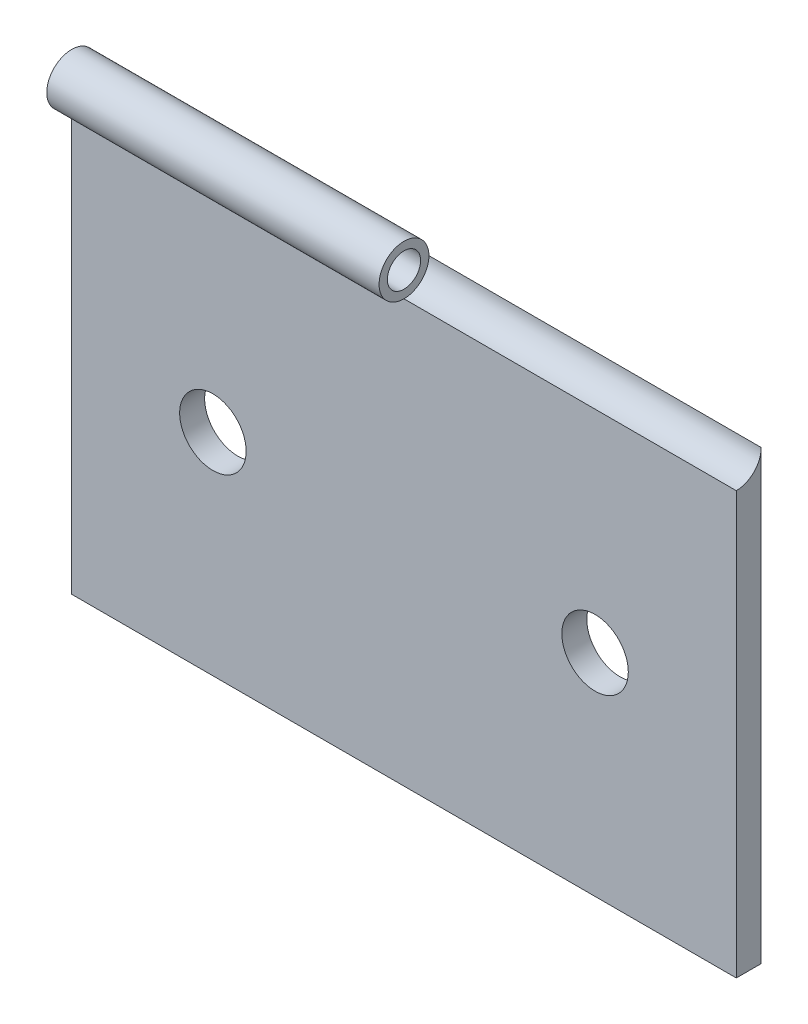
ISO-10303-21;
HEADER;
FILE_DESCRIPTION(('STEP AP214'),'2;1');
FILE_NAME('part.step','',(''),(''),'','','');
FILE_SCHEMA(('AUTOMOTIVE_DESIGN { 1 0 10303 214 1 1 1 1 }'));
ENDSEC;
DATA;
#1=APPLICATION_CONTEXT('core data for automotive mechanical design processes');
#2=APPLICATION_PROTOCOL_DEFINITION('international standard','automotive_design',2000,#1);
#3=PRODUCT_CONTEXT('',#1,'mechanical');
#4=PRODUCT('Part','Part','',(#3));
#5=PRODUCT_RELATED_PRODUCT_CATEGORY('part','',(#4));
#6=PRODUCT_DEFINITION_FORMATION('','',#4);
#7=PRODUCT_DEFINITION_CONTEXT('part definition',#1,'design');
#8=PRODUCT_DEFINITION('design','',#6,#7);
#9=PRODUCT_DEFINITION_SHAPE('','',#8);
#10=(LENGTH_UNIT() NAMED_UNIT(*) SI_UNIT(.MILLI.,.METRE.));
#11=(NAMED_UNIT(*) PLANE_ANGLE_UNIT() SI_UNIT($,.RADIAN.));
#12=(NAMED_UNIT(*) SI_UNIT($,.STERADIAN.) SOLID_ANGLE_UNIT());
#13=UNCERTAINTY_MEASURE_WITH_UNIT(LENGTH_MEASURE(1.E-05),#10,'distance_accuracy_value','');
#14=(GEOMETRIC_REPRESENTATION_CONTEXT(3) GLOBAL_UNCERTAINTY_ASSIGNED_CONTEXT((#13)) GLOBAL_UNIT_ASSIGNED_CONTEXT((#10,
#11,#12)) REPRESENTATION_CONTEXT('',''));
#15=CARTESIAN_POINT('',(0.,0.,0.));
#16=DIRECTION('',(0.,0.,1.));
#17=DIRECTION('',(1.,0.,0.));
#18=AXIS2_PLACEMENT_3D('',#15,#16,#17);
#19=CARTESIAN_POINT('',(-20.,14.2000000000003,0.750000000000015));
#20=DIRECTION('',(1.,0.,0.));
#21=DIRECTION('',(0.,0.,-1.));
#22=AXIS2_PLACEMENT_3D('',#19,#20,#21);
#23=CYLINDRICAL_SURFACE('',#22,1.5);
#24=DIRECTION('',(1.,0.,0.));
#25=VECTOR('',#24,1.);
#26=CARTESIAN_POINT('',(-20.,12.7000000000003,0.750000000000015));
#27=LINE('',#26,#25);
#28=CARTESIAN_POINT('',(-20.,12.7000000000003,0.750000000000015));
#29=VERTEX_POINT('',#28);
#30=CARTESIAN_POINT('',(0.,12.7000000000004,0.750000000000001));
#31=VERTEX_POINT('',#30);
#32=EDGE_CURVE('E107',#29,#31,#27,.T.);
#33=ORIENTED_EDGE('',*,*,#32,.T.);
#34=CARTESIAN_POINT('',(0.,14.2000000000004,0.750000000000015));
#35=DIRECTION('',(1.,0.,0.));
#36=DIRECTION('',(0.,0.,-1.));
#37=AXIS2_PLACEMENT_3D('',#34,#35,#36);
#38=CIRCLE('',#37,1.5);
#39=CARTESIAN_POINT('',(0.,14.2000000000005,-0.749999999999987));
#40=VERTEX_POINT('',#39);
#41=EDGE_CURVE('E99',#40,#31,#38,.T.);
#42=ORIENTED_EDGE('',*,*,#41,.F.);
#43=DIRECTION('',(1.,0.,0.));
#44=VECTOR('',#43,1.);
#45=CARTESIAN_POINT('',(-20.,14.2000000000004,-0.749999999999987));
#46=LINE('',#45,#44);
#47=CARTESIAN_POINT('',(-20.,14.2000000000004,-0.749999999999987));
#48=VERTEX_POINT('',#47);
#49=EDGE_CURVE('E106',#48,#40,#46,.T.);
#50=ORIENTED_EDGE('',*,*,#49,.F.);
#51=CARTESIAN_POINT('',(-20.,14.2000000000003,0.750000000000015));
#52=DIRECTION('',(1.,0.,0.));
#53=DIRECTION('',(0.,0.,-1.));
#54=AXIS2_PLACEMENT_3D('',#51,#52,#53);
#55=CIRCLE('',#54,1.5);
#56=EDGE_CURVE('E119',#48,#29,#55,.T.);
#57=ORIENTED_EDGE('',*,*,#56,.T.);
#58=EDGE_LOOP('',(#33,#42,#50,#57));
#59=FACE_BOUND('',#58,.T.);
#60=ADVANCED_FACE('F36',(#59),#23,.T.);
#61=CARTESIAN_POINT('',(-20.,14.2000000000003,0.750000000000015));
#62=DIRECTION('',(1.,0.,0.));
#63=DIRECTION('',(0.,0.,-1.));
#64=AXIS2_PLACEMENT_3D('',#61,#62,#63);
#65=CYLINDRICAL_SURFACE('',#64,1.);
#66=CARTESIAN_POINT('',(-20.,14.2000000000003,0.750000000000015));
#67=DIRECTION('',(1.,0.,0.));
#68=DIRECTION('',(0.,0.,-1.));
#69=AXIS2_PLACEMENT_3D('',#66,#67,#68);
#70=CIRCLE('',#69,1.);
#71=CARTESIAN_POINT('',(-20.,14.2000000000003,-0.24999999999999));
#72=VERTEX_POINT('',#71);
#73=EDGE_CURVE('E122',#72,#72,#70,.T.);
#74=ORIENTED_EDGE('',*,*,#73,.F.);
#75=EDGE_LOOP('',(#74));
#76=FACE_BOUND('',#75,.T.);
#77=CARTESIAN_POINT('',(0.,14.2000000000004,0.750000000000015));
#78=DIRECTION('',(1.,0.,0.));
#79=DIRECTION('',(0.,0.,-1.));
#80=AXIS2_PLACEMENT_3D('',#77,#78,#79);
#81=CIRCLE('',#80,1.);
#82=CARTESIAN_POINT('',(0.,14.2000000000004,-0.24999999999999));
#83=VERTEX_POINT('',#82);
#84=EDGE_CURVE('E39',#83,#83,#81,.F.);
#85=ORIENTED_EDGE('',*,*,#84,.F.);
#86=EDGE_LOOP('',(#85));
#87=FACE_BOUND('',#86,.T.);
#88=ADVANCED_FACE('F170',(#76,#87),#65,.F.);
#89=CARTESIAN_POINT('',(-20.,-12.7,-0.749999999999959));
#90=DIRECTION('',(0.,0.,-1.));
#91=DIRECTION('',(-1.,0.,0.));
#92=AXIS2_PLACEMENT_3D('',#89,#90,#91);
#93=PLANE('',#92);
#94=CARTESIAN_POINT('',(-11.5,0.,-0.749999999999973));
#95=DIRECTION('',(0.,0.,-1.));
#96=DIRECTION('',(-1.,0.,0.));
#97=AXIS2_PLACEMENT_3D('',#94,#95,#96);
#98=CIRCLE('',#97,2.);
#99=CARTESIAN_POINT('',(-13.5,0.,-0.749999999999973));
#100=VERTEX_POINT('',#99);
#101=EDGE_CURVE('E101',#100,#100,#98,.F.);
#102=ORIENTED_EDGE('',*,*,#101,.T.);
#103=EDGE_LOOP('',(#102));
#104=FACE_BOUND('',#103,.T.);
#105=CARTESIAN_POINT('',(11.4999999999999,0.,-0.750000000000001));
#106=DIRECTION('',(0.,0.,-1.));
#107=DIRECTION('',(-1.,0.,0.));
#108=AXIS2_PLACEMENT_3D('',#105,#106,#107);
#109=CIRCLE('',#108,2.);
#110=CARTESIAN_POINT('',(9.4999999999999,0.,-0.750000000000001));
#111=VERTEX_POINT('',#110);
#112=EDGE_CURVE('E134',#111,#111,#109,.F.);
#113=ORIENTED_EDGE('',*,*,#112,.T.);
#114=EDGE_LOOP('',(#113));
#115=FACE_BOUND('',#114,.T.);
#116=ORIENTED_EDGE('',*,*,#49,.T.);
#117=DIRECTION('',(1.,0.,0.));
#118=VECTOR('',#117,1.);
#119=CARTESIAN_POINT('',(0.,14.2000000000005,-0.749999999999987));
#120=LINE('',#119,#118);
#121=CARTESIAN_POINT('',(20.,14.2000000000005,-0.749999999999987));
#122=VERTEX_POINT('',#121);
#123=EDGE_CURVE('E83',#40,#122,#120,.T.);
#124=ORIENTED_EDGE('',*,*,#123,.T.);
#125=DIRECTION('',(0.,1.,0.));
#126=VECTOR('',#125,1.);
#127=CARTESIAN_POINT('',(20.,12.7000000000005,-0.750000000000028));
#128=LINE('',#127,#126);
#129=CARTESIAN_POINT('',(19.9999999999999,-12.6999999999999,-0.749999999999987));
#130=VERTEX_POINT('',#129);
#131=EDGE_CURVE('E131',#130,#122,#128,.T.);
#132=ORIENTED_EDGE('',*,*,#131,.F.);
#133=DIRECTION('',(1.,0.,0.));
#134=VECTOR('',#133,1.);
#135=CARTESIAN_POINT('',(-20.,-12.7,-0.749999999999959));
#136=LINE('',#135,#134);
#137=CARTESIAN_POINT('',(-20.,-12.7,-0.749999999999959));
#138=VERTEX_POINT('',#137);
#139=EDGE_CURVE('E44',#138,#130,#136,.T.);
#140=ORIENTED_EDGE('',*,*,#139,.F.);
#141=DIRECTION('',(0.,1.,0.));
#142=VECTOR('',#141,1.);
#143=CARTESIAN_POINT('',(-20.,12.7000000000004,-0.749999999999987));
#144=LINE('',#143,#142);
#145=EDGE_CURVE('E51',#138,#48,#144,.T.);
#146=ORIENTED_EDGE('',*,*,#145,.T.);
#147=EDGE_LOOP('',(#116,#124,#132,#140,#146));
#148=FACE_BOUND('',#147,.T.);
#149=ADVANCED_FACE('F108',(#104,#115,#148),#93,.T.);
#150=CARTESIAN_POINT('',(-20.,-12.7000000000001,0.750000000000042));
#151=DIRECTION('',(0.,-1.,0.));
#152=DIRECTION('',(0.,0.,-1.));
#153=AXIS2_PLACEMENT_3D('',#150,#151,#152);
#154=PLANE('',#153);
#155=ORIENTED_EDGE('',*,*,#139,.T.);
#156=DIRECTION('',(0.,0.,-1.));
#157=VECTOR('',#156,1.);
#158=CARTESIAN_POINT('',(19.9999999999999,-12.6999999999999,0.750000000000001));
#159=LINE('',#158,#157);
#160=CARTESIAN_POINT('',(19.9999999999999,-12.6999999999999,0.750000000000001));
#161=VERTEX_POINT('',#160);
#162=EDGE_CURVE('E125',#161,#130,#159,.T.);
#163=ORIENTED_EDGE('',*,*,#162,.F.);
#164=DIRECTION('',(1.,0.,0.));
#165=VECTOR('',#164,1.);
#166=CARTESIAN_POINT('',(-20.,-12.7000000000001,0.750000000000042));
#167=LINE('',#166,#165);
#168=CARTESIAN_POINT('',(-20.,-12.7000000000001,0.750000000000042));
#169=VERTEX_POINT('',#168);
#170=EDGE_CURVE('E59',#169,#161,#167,.T.);
#171=ORIENTED_EDGE('',*,*,#170,.F.);
#172=DIRECTION('',(0.,0.,-1.));
#173=VECTOR('',#172,1.);
#174=CARTESIAN_POINT('',(-20.,-12.7000000000001,0.750000000000042));
#175=LINE('',#174,#173);
#176=EDGE_CURVE('E109',#169,#138,#175,.T.);
#177=ORIENTED_EDGE('',*,*,#176,.T.);
#178=EDGE_LOOP('',(#155,#163,#171,#177));
#179=FACE_BOUND('',#178,.T.);
#180=ADVANCED_FACE('F153',(#179),#154,.T.);
#181=CARTESIAN_POINT('',(-20.,-12.7000000000001,0.750000000000042));
#182=DIRECTION('',(0.,0.,1.));
#183=DIRECTION('',(1.,0.,0.));
#184=AXIS2_PLACEMENT_3D('',#181,#182,#183);
#185=PLANE('',#184);
#186=CARTESIAN_POINT('',(-11.5,0.,0.750000000000028));
#187=DIRECTION('',(0.,0.,1.));
#188=DIRECTION('',(1.,0.,0.));
#189=AXIS2_PLACEMENT_3D('',#186,#187,#188);
#190=CIRCLE('',#189,2.);
#191=CARTESIAN_POINT('',(-9.50000000000001,0.,0.750000000000028));
#192=VERTEX_POINT('',#191);
#193=EDGE_CURVE('E137',#192,#192,#190,.T.);
#194=ORIENTED_EDGE('',*,*,#193,.F.);
#195=EDGE_LOOP('',(#194));
#196=FACE_BOUND('',#195,.T.);
#197=CARTESIAN_POINT('',(11.5,0.,0.750000000000001));
#198=DIRECTION('',(0.,0.,1.));
#199=DIRECTION('',(1.,0.,0.));
#200=AXIS2_PLACEMENT_3D('',#197,#198,#199);
#201=CIRCLE('',#200,2.);
#202=CARTESIAN_POINT('',(13.5,0.,0.750000000000001));
#203=VERTEX_POINT('',#202);
#204=EDGE_CURVE('E138',#203,#203,#201,.T.);
#205=ORIENTED_EDGE('',*,*,#204,.F.);
#206=EDGE_LOOP('',(#205));
#207=FACE_BOUND('',#206,.T.);
#208=ORIENTED_EDGE('',*,*,#170,.T.);
#209=DIRECTION('',(0.,-1.,0.));
#210=VECTOR('',#209,1.);
#211=CARTESIAN_POINT('',(19.9999999999999,-12.6999999999999,0.750000000000001));
#212=LINE('',#211,#210);
#213=CARTESIAN_POINT('',(19.9999999999999,12.7000000000005,0.749999999999973));
#214=VERTEX_POINT('',#213);
#215=EDGE_CURVE('E128',#214,#161,#212,.T.);
#216=ORIENTED_EDGE('',*,*,#215,.F.);
#217=DIRECTION('',(1.,0.,0.));
#218=VECTOR('',#217,1.);
#219=CARTESIAN_POINT('',(0.,12.7000000000004,0.750000000000001));
#220=LINE('',#219,#218);
#221=EDGE_CURVE('E93',#31,#214,#220,.T.);
#222=ORIENTED_EDGE('',*,*,#221,.F.);
#223=ORIENTED_EDGE('',*,*,#32,.F.);
#224=DIRECTION('',(0.,-1.,0.));
#225=VECTOR('',#224,1.);
#226=CARTESIAN_POINT('',(-20.,-12.7000000000001,0.750000000000042));
#227=LINE('',#226,#225);
#228=EDGE_CURVE('E112',#29,#169,#227,.T.);
#229=ORIENTED_EDGE('',*,*,#228,.T.);
#230=EDGE_LOOP('',(#208,#216,#222,#223,#229));
#231=FACE_BOUND('',#230,.T.);
#232=ADVANCED_FACE('F149',(#196,#207,#231),#185,.T.);
#233=CARTESIAN_POINT('',(-20.,14.2000000000003,0.750000000000015));
#234=DIRECTION('',(1.,0.,0.));
#235=DIRECTION('',(0.,0.,-1.));
#236=AXIS2_PLACEMENT_3D('',#233,#234,#235);
#237=PLANE('',#236);
#238=ORIENTED_EDGE('',*,*,#73,.T.);
#239=EDGE_LOOP('',(#238));
#240=FACE_BOUND('',#239,.T.);
#241=ORIENTED_EDGE('',*,*,#145,.F.);
#242=ORIENTED_EDGE('',*,*,#176,.F.);
#243=ORIENTED_EDGE('',*,*,#228,.F.);
#244=ORIENTED_EDGE('',*,*,#56,.F.);
#245=EDGE_LOOP('',(#241,#242,#243,#244));
#246=FACE_BOUND('',#245,.T.);
#247=ADVANCED_FACE('F152',(#240,#246),#237,.F.);
#248=CARTESIAN_POINT('',(19.9999999999999,14.2000000000005,0.750000000000015));
#249=DIRECTION('',(1.,0.,0.));
#250=DIRECTION('',(0.,0.,-1.));
#251=AXIS2_PLACEMENT_3D('',#248,#249,#250);
#252=PLANE('',#251);
#253=CARTESIAN_POINT('',(19.9999999999999,14.2000000000005,0.750000000000015));
#254=DIRECTION('',(1.,0.,0.));
#255=DIRECTION('',(0.,0.,-1.));
#256=AXIS2_PLACEMENT_3D('',#253,#254,#255);
#257=CIRCLE('',#256,1.5);
#258=EDGE_CURVE('E11',#214,#122,#257,.T.);
#259=ORIENTED_EDGE('',*,*,#258,.F.);
#260=ORIENTED_EDGE('',*,*,#215,.T.);
#261=ORIENTED_EDGE('',*,*,#162,.T.);
#262=ORIENTED_EDGE('',*,*,#131,.T.);
#263=EDGE_LOOP('',(#259,#260,#261,#262));
#264=FACE_BOUND('',#263,.T.);
#265=ADVANCED_FACE('F159',(#264),#252,.T.);
#266=CARTESIAN_POINT('',(0.,14.2000000000004,0.750000000000015));
#267=DIRECTION('',(1.,0.,0.));
#268=DIRECTION('',(0.,0.,-1.));
#269=AXIS2_PLACEMENT_3D('',#266,#267,#268);
#270=PLANE('',#269);
#271=ORIENTED_EDGE('',*,*,#41,.T.);
#272=EDGE_CURVE('E86',#31,#40,#38,.T.);
#273=ORIENTED_EDGE('',*,*,#272,.T.);
#274=EDGE_LOOP('',(#271,#273));
#275=FACE_BOUND('',#274,.T.);
#276=ORIENTED_EDGE('',*,*,#84,.T.);
#277=EDGE_LOOP('',(#276));
#278=FACE_BOUND('',#277,.T.);
#279=ADVANCED_FACE('F97',(#275,#278),#270,.T.);
#280=CARTESIAN_POINT('',(0.,14.2000000000004,0.750000000000015));
#281=DIRECTION('',(1.,0.,0.));
#282=DIRECTION('',(0.,0.,-1.));
#283=AXIS2_PLACEMENT_3D('',#280,#281,#282);
#284=CYLINDRICAL_SURFACE('',#283,1.5);
#285=ORIENTED_EDGE('',*,*,#272,.F.);
#286=ORIENTED_EDGE('',*,*,#221,.T.);
#287=ORIENTED_EDGE('',*,*,#258,.T.);
#288=ORIENTED_EDGE('',*,*,#123,.F.);
#289=EDGE_LOOP('',(#285,#286,#287,#288));
#290=FACE_BOUND('',#289,.T.);
#291=ADVANCED_FACE('F85',(#290),#284,.F.);
#292=CARTESIAN_POINT('',(11.5,0.,-6.40685424949242));
#293=DIRECTION('',(0.,0.,1.));
#294=DIRECTION('',(1.,0.,0.));
#295=AXIS2_PLACEMENT_3D('',#292,#293,#294);
#296=CYLINDRICAL_SURFACE('',#295,2.);
#297=ORIENTED_EDGE('',*,*,#204,.T.);
#298=EDGE_LOOP('',(#297));
#299=FACE_BOUND('',#298,.T.);
#300=ORIENTED_EDGE('',*,*,#112,.F.);
#301=EDGE_LOOP('',(#300));
#302=FACE_BOUND('',#301,.T.);
#303=ADVANCED_FACE('F184',(#299,#302),#296,.F.);
#304=CARTESIAN_POINT('',(-11.5000000000001,0.,-6.40685424949239));
#305=DIRECTION('',(0.,0.,1.));
#306=DIRECTION('',(1.,0.,0.));
#307=AXIS2_PLACEMENT_3D('',#304,#305,#306);
#308=CYLINDRICAL_SURFACE('',#307,2.);
#309=ORIENTED_EDGE('',*,*,#193,.T.);
#310=EDGE_LOOP('',(#309));
#311=FACE_BOUND('',#310,.T.);
#312=ORIENTED_EDGE('',*,*,#101,.F.);
#313=EDGE_LOOP('',(#312));
#314=FACE_BOUND('',#313,.T.);
#315=ADVANCED_FACE('F146',(#311,#314),#308,.F.);
#316=CLOSED_SHELL('',(#60,#88,#149,#180,#232,#247,#265,#279,#291,#303,#315));
#317=MANIFOLD_SOLID_BREP('B2',#316);
#318=ADVANCED_BREP_SHAPE_REPRESENTATION('',(#18,#317),#14);
#319=SHAPE_DEFINITION_REPRESENTATION(#9,#318);
ENDSEC;
END-ISO-10303-21;
